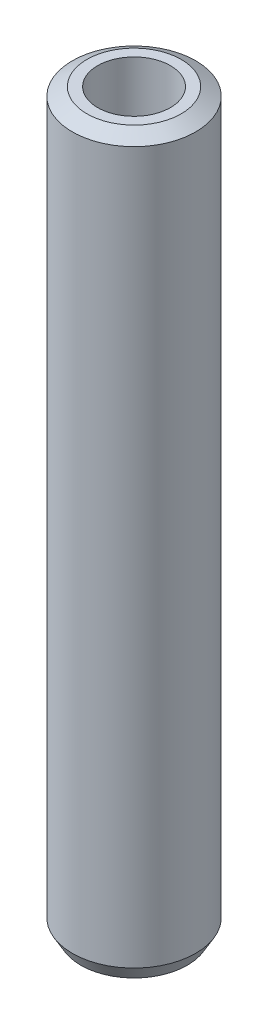
ISO-10303-21;
HEADER;
FILE_DESCRIPTION(('STEP AP214'),'2;1');
FILE_NAME('part.step','',(''),(''),'','','');
FILE_SCHEMA(('AUTOMOTIVE_DESIGN { 1 0 10303 214 1 1 1 1 }'));
ENDSEC;
DATA;
#1=APPLICATION_CONTEXT('core data for automotive mechanical design processes');
#2=APPLICATION_PROTOCOL_DEFINITION('international standard','automotive_design',2000,#1);
#3=PRODUCT_CONTEXT('',#1,'mechanical');
#4=PRODUCT('Part','Part','',(#3));
#5=PRODUCT_RELATED_PRODUCT_CATEGORY('part','',(#4));
#6=PRODUCT_DEFINITION_FORMATION('','',#4);
#7=PRODUCT_DEFINITION_CONTEXT('part definition',#1,'design');
#8=PRODUCT_DEFINITION('design','',#6,#7);
#9=PRODUCT_DEFINITION_SHAPE('','',#8);
#10=(LENGTH_UNIT() NAMED_UNIT(*) SI_UNIT(.MILLI.,.METRE.));
#11=(NAMED_UNIT(*) PLANE_ANGLE_UNIT() SI_UNIT($,.RADIAN.));
#12=(NAMED_UNIT(*) SI_UNIT($,.STERADIAN.) SOLID_ANGLE_UNIT());
#13=UNCERTAINTY_MEASURE_WITH_UNIT(LENGTH_MEASURE(1.E-05),#10,'distance_accuracy_value','');
#14=(GEOMETRIC_REPRESENTATION_CONTEXT(3) GLOBAL_UNCERTAINTY_ASSIGNED_CONTEXT((#13)) GLOBAL_UNIT_ASSIGNED_CONTEXT((#10,
#11,#12)) REPRESENTATION_CONTEXT('',''));
#15=CARTESIAN_POINT('',(0.,0.,0.));
#16=DIRECTION('',(0.,0.,1.));
#17=DIRECTION('',(1.,0.,0.));
#18=AXIS2_PLACEMENT_3D('',#15,#16,#17);
#19=CARTESIAN_POINT('',(0.,297.604528577558,0.));
#20=DIRECTION('',(0.,-1.,0.));
#21=DIRECTION('',(0.,0.,-1.));
#22=AXIS2_PLACEMENT_3D('',#19,#20,#21);
#23=CYLINDRICAL_SURFACE('',#22,25.);
#24=CARTESIAN_POINT('',(0.,294.204174490772,0.));
#25=DIRECTION('',(0.,1.,0.));
#26=DIRECTION('',(0.,0.,1.));
#27=AXIS2_PLACEMENT_3D('',#24,#25,#26);
#28=CIRCLE('',#27,25.);
#29=CARTESIAN_POINT('',(0.,294.204174490772,-25.));
#30=VERTEX_POINT('',#29);
#31=EDGE_CURVE('E50',#30,#30,#28,.F.);
#32=CARTESIAN_POINT('',(0.,5.88958604203754,0.));
#33=DIRECTION('',(0.,1.,0.));
#34=DIRECTION('',(0.,0.,1.));
#35=AXIS2_PLACEMENT_3D('',#32,#33,#34);
#36=CIRCLE('',#35,25.);
#37=CARTESIAN_POINT('',(0.,5.88958604203749,-25.));
#38=VERTEX_POINT('',#37);
#39=EDGE_CURVE('E51',#38,#38,#36,.T.);
#40=CARTESIAN_POINT('',(0.,294.204174490772,-25.));
#41=CARTESIAN_POINT('',(0.,291.200897527764,-25.));
#42=CARTESIAN_POINT('',(0.,288.197620564757,-25.));
#43=CARTESIAN_POINT('',(0.,282.191066638741,-25.));
#44=CARTESIAN_POINT('',(0.,279.187789675734,-25.));
#45=CARTESIAN_POINT('',(0.,273.181235749718,-25.));
#46=CARTESIAN_POINT('',(0.,270.177958786711,-25.));
#47=CARTESIAN_POINT('',(0.,264.171404860696,-25.));
#48=CARTESIAN_POINT('',(0.,261.168127897688,-25.));
#49=CARTESIAN_POINT('',(0.,255.161573971673,-25.));
#50=CARTESIAN_POINT('',(0.,252.158297008665,-25.));
#51=CARTESIAN_POINT('',(0.,246.15174308265,-25.));
#52=CARTESIAN_POINT('',(0.,243.148466119642,-25.));
#53=CARTESIAN_POINT('',(0.,237.141912193627,-25.));
#54=CARTESIAN_POINT('',(0.,234.138635230619,-25.));
#55=CARTESIAN_POINT('',(0.,228.132081304604,-25.));
#56=CARTESIAN_POINT('',(0.,225.128804341596,-25.));
#57=CARTESIAN_POINT('',(0.,219.122250415581,-25.));
#58=CARTESIAN_POINT('',(0.,216.118973452573,-25.));
#59=CARTESIAN_POINT('',(0.,210.112419526558,-25.));
#60=CARTESIAN_POINT('',(0.,207.10914256355,-25.));
#61=CARTESIAN_POINT('',(0.,201.102588637535,-25.));
#62=CARTESIAN_POINT('',(0.,198.099311674527,-25.));
#63=CARTESIAN_POINT('',(0.,192.092757748512,-25.));
#64=CARTESIAN_POINT('',(0.,189.089480785504,-25.));
#65=CARTESIAN_POINT('',(0.,183.082926859489,-25.));
#66=CARTESIAN_POINT('',(0.,180.079649896481,-25.));
#67=CARTESIAN_POINT('',(0.,174.073095970466,-25.));
#68=CARTESIAN_POINT('',(0.,171.069819007458,-25.));
#69=CARTESIAN_POINT('',(0.,165.063265081443,-25.));
#70=CARTESIAN_POINT('',(0.,162.059988118435,-25.));
#71=CARTESIAN_POINT('',(0.,156.05343419242,-25.));
#72=CARTESIAN_POINT('',(0.,153.050157229412,-25.));
#73=CARTESIAN_POINT('',(0.,147.043603303397,-25.));
#74=CARTESIAN_POINT('',(0.,144.040326340389,-25.));
#75=CARTESIAN_POINT('',(0.,138.033772414374,-25.));
#76=CARTESIAN_POINT('',(0.,135.030495451367,-25.));
#77=CARTESIAN_POINT('',(0.,129.023941525351,-25.));
#78=CARTESIAN_POINT('',(0.,126.020664562344,-25.));
#79=CARTESIAN_POINT('',(0.,120.014110636328,-25.));
#80=CARTESIAN_POINT('',(0.,117.010833673321,-25.));
#81=CARTESIAN_POINT('',(0.,111.004279747305,-25.));
#82=CARTESIAN_POINT('',(0.,108.001002784298,-25.));
#83=CARTESIAN_POINT('',(0.,101.994448858282,-25.));
#84=CARTESIAN_POINT('',(0.,98.9911718952747,-25.));
#85=CARTESIAN_POINT('',(0.,92.9846179692594,-25.));
#86=CARTESIAN_POINT('',(0.,89.9813410062518,-25.));
#87=CARTESIAN_POINT('',(0.,83.9747870802364,-25.));
#88=CARTESIAN_POINT('',(0.,80.9715101172288,-25.));
#89=CARTESIAN_POINT('',(0.,74.9649561912135,-25.));
#90=CARTESIAN_POINT('',(0.,71.9616792282058,-25.));
#91=CARTESIAN_POINT('',(0.,65.9551253021905,-25.));
#92=CARTESIAN_POINT('',(0.,62.9518483391829,-25.));
#93=CARTESIAN_POINT('',(0.,56.9452944131676,-25.));
#94=CARTESIAN_POINT('',(0.,53.9420174501599,-25.));
#95=CARTESIAN_POINT('',(0.,47.9354635241446,-25.));
#96=CARTESIAN_POINT('',(0.,44.932186561137,-25.));
#97=CARTESIAN_POINT('',(0.,38.9256326351217,-25.));
#98=CARTESIAN_POINT('',(0.,35.922355672114,-25.));
#99=CARTESIAN_POINT('',(0.,29.9158017460987,-25.));
#100=CARTESIAN_POINT('',(0.,26.9125247830911,-25.));
#101=CARTESIAN_POINT('',(0.,20.9059708570758,-25.));
#102=CARTESIAN_POINT('',(0.,17.9026938940681,-25.));
#103=CARTESIAN_POINT('',(0.,11.8961399680528,-25.));
#104=CARTESIAN_POINT('',(0.,8.89286300504514,-25.));
#105=CARTESIAN_POINT('',(0.,5.88958604203749,-25.));
#106=B_SPLINE_CURVE_WITH_KNOTS('',3,(#40,#41,#42,#43,#44,#45,#46,#47,#48,#49,#50,#51,#52,#53,
#54,#55,#56,#57,#58,#59,#60,#61,#62,#63,#64,#65,#66,#67,#68,#69,#70,#71,#72,#73,#74,#75,#76,#77,
#78,#79,#80,#81,#82,#83,#84,#85,#86,#87,#88,#89,#90,#91,#92,#93,#94,#95,#96,#97,#98,#99,#100,
#101,#102,#103,#104,#105),.UNSPECIFIED.,.F.,.F.,(4,2,2,2,2,2,2,2,2,2,2,2,2,2,2,2,2,2,2,2,2,2,2,
2,2,2,2,2,2,2,2,2,4),(0.,9.00983088902291,18.0196617780459,27.0294926670688,36.0393235560918,
45.0491544451148,54.0589853341377,63.0688162231606,72.0786471121836,81.0884780012066,
90.0983088902295,99.1081397792525,108.117970668275,117.127801557298,126.137632446321,
135.147463335344,144.157294224367,153.16712511339,162.176956002413,171.186786891436,
180.196617780459,189.206448669482,198.216279558505,207.226110447528,216.235941336551,
225.245772225574,234.255603114597,243.26543400362,252.275264892643,261.285095781666,
270.294926670689,279.304757559712,288.314588448735),.UNSPECIFIED.);
#107=EDGE_CURVE('BSEAM39',#30,#38,#106,.T.);
#108=ORIENTED_EDGE('',*,*,#31,.T.);
#109=ORIENTED_EDGE('',*,*,#39,.T.);
#110=ORIENTED_EDGE('',*,*,#107,.T.);
#111=ORIENTED_EDGE('',*,*,#107,.F.);
#112=EDGE_LOOP('',(#108,#110,#109,#111));
#113=FACE_BOUND('',#112,.T.);
#114=ADVANCED_FACE('F39',(#113),#23,.T.);
#115=CARTESIAN_POINT('',(0.,297.604528577558,0.));
#116=DIRECTION('',(0.,1.,0.));
#117=DIRECTION('',(0.,0.,1.));
#118=AXIS2_PLACEMENT_3D('',#115,#116,#117);
#119=PLANE('',#118);
#120=CARTESIAN_POINT('',(0.,297.604528577558,0.));
#121=DIRECTION('',(0.,1.,0.));
#122=DIRECTION('',(0.,0.,1.));
#123=AXIS2_PLACEMENT_3D('',#120,#121,#122);
#124=CIRCLE('',#123,19.1104139579631);
#125=CARTESIAN_POINT('',(0.,297.604528577557,-19.1104139579632));
#126=VERTEX_POINT('',#125);
#127=EDGE_CURVE('E54',#126,#126,#124,.T.);
#128=ORIENTED_EDGE('',*,*,#127,.T.);
#129=EDGE_LOOP('',(#128));
#130=FACE_BOUND('',#129,.T.);
#131=CARTESIAN_POINT('',(0.,297.604528577558,0.));
#132=DIRECTION('',(0.,1.,0.));
#133=DIRECTION('',(0.,0.,1.));
#134=AXIS2_PLACEMENT_3D('',#131,#132,#133);
#135=CIRCLE('',#134,14.7536107935346);
#136=CARTESIAN_POINT('',(0.,297.604528577558,-14.7536107935346));
#137=VERTEX_POINT('',#136);
#138=EDGE_CURVE('E58',#137,#137,#135,.T.);
#139=ORIENTED_EDGE('',*,*,#138,.F.);
#140=EDGE_LOOP('',(#139));
#141=FACE_BOUND('',#140,.T.);
#142=ADVANCED_FACE('F69',(#130,#141),#119,.T.);
#143=CARTESIAN_POINT('',(0.,0.,0.));
#144=DIRECTION('',(0.,1.,0.));
#145=DIRECTION('',(0.,0.,1.));
#146=AXIS2_PLACEMENT_3D('',#143,#144,#145);
#147=PLANE('',#146);
#148=CARTESIAN_POINT('',(0.,0.,0.));
#149=DIRECTION('',(0.,1.,0.));
#150=DIRECTION('',(0.,0.,1.));
#151=AXIS2_PLACEMENT_3D('',#148,#149,#150);
#152=CIRCLE('',#151,21.5996459132142);
#153=CARTESIAN_POINT('',(0.,0.,21.5996459132142));
#154=VERTEX_POINT('',#153);
#155=EDGE_CURVE('E10',#154,#154,#152,.F.);
#156=ORIENTED_EDGE('',*,*,#155,.T.);
#157=EDGE_LOOP('',(#156));
#158=FACE_BOUND('',#157,.T.);
#159=CARTESIAN_POINT('',(0.,0.,0.));
#160=DIRECTION('',(0.,1.,0.));
#161=DIRECTION('',(0.,0.,1.));
#162=AXIS2_PLACEMENT_3D('',#159,#160,#161);
#163=CIRCLE('',#162,14.7536107935346);
#164=CARTESIAN_POINT('',(0.,0.,-14.7536107935346));
#165=VERTEX_POINT('',#164);
#166=EDGE_CURVE('E63',#165,#165,#163,.T.);
#167=ORIENTED_EDGE('',*,*,#166,.T.);
#168=EDGE_LOOP('',(#167));
#169=FACE_BOUND('',#168,.T.);
#170=ADVANCED_FACE('F75',(#158,#169),#147,.F.);
#171=CARTESIAN_POINT('',(0.,297.604528577558,0.));
#172=DIRECTION('',(0.,-1.,0.));
#173=DIRECTION('',(0.,0.,-1.));
#174=AXIS2_PLACEMENT_3D('',#171,#172,#173);
#175=CYLINDRICAL_SURFACE('',#174,14.7536107935346);
#176=CARTESIAN_POINT('',(0.,297.604528577558,-14.7536107935346));
#177=CARTESIAN_POINT('',(0.,294.504481404875,-14.7536107935346));
#178=CARTESIAN_POINT('',(0.,291.404434232192,-14.7536107935346));
#179=CARTESIAN_POINT('',(0.,285.204339886826,-14.7536107935346));
#180=CARTESIAN_POINT('',(0.,282.104292714143,-14.7536107935346));
#181=CARTESIAN_POINT('',(0.,275.904198368777,-14.7536107935346));
#182=CARTESIAN_POINT('',(0.,272.804151196094,-14.7536107935346));
#183=CARTESIAN_POINT('',(0.,266.604056850729,-14.7536107935346));
#184=CARTESIAN_POINT('',(0.,263.504009678046,-14.7536107935346));
#185=CARTESIAN_POINT('',(0.,257.30391533268,-14.7536107935346));
#186=CARTESIAN_POINT('',(0.,254.203868159997,-14.7536107935346));
#187=CARTESIAN_POINT('',(0.,248.003773814631,-14.7536107935346));
#188=CARTESIAN_POINT('',(0.,244.903726641948,-14.7536107935346));
#189=CARTESIAN_POINT('',(0.,238.703632296583,-14.7536107935346));
#190=CARTESIAN_POINT('',(0.,235.6035851239,-14.7536107935346));
#191=CARTESIAN_POINT('',(0.,229.403490778534,-14.7536107935346));
#192=CARTESIAN_POINT('',(0.,226.303443605851,-14.7536107935346));
#193=CARTESIAN_POINT('',(0.,220.103349260485,-14.7536107935346));
#194=CARTESIAN_POINT('',(0.,217.003302087802,-14.7536107935346));
#195=CARTESIAN_POINT('',(0.,210.803207742437,-14.7536107935346));
#196=CARTESIAN_POINT('',(0.,207.703160569754,-14.7536107935346));
#197=CARTESIAN_POINT('',(0.,201.503066224388,-14.7536107935346));
#198=CARTESIAN_POINT('',(0.,198.403019051705,-14.7536107935346));
#199=CARTESIAN_POINT('',(0.,192.202924706339,-14.7536107935346));
#200=CARTESIAN_POINT('',(0.,189.102877533656,-14.7536107935346));
#201=CARTESIAN_POINT('',(0.,182.902783188291,-14.7536107935346));
#202=CARTESIAN_POINT('',(0.,179.802736015608,-14.7536107935346));
#203=CARTESIAN_POINT('',(0.,173.602641670242,-14.7536107935346));
#204=CARTESIAN_POINT('',(0.,170.502594497559,-14.7536107935346));
#205=CARTESIAN_POINT('',(0.,164.302500152193,-14.7536107935346));
#206=CARTESIAN_POINT('',(0.,161.20245297951,-14.7536107935346));
#207=CARTESIAN_POINT('',(0.,155.002358634145,-14.7536107935346));
#208=CARTESIAN_POINT('',(0.,151.902311461462,-14.7536107935346));
#209=CARTESIAN_POINT('',(0.,145.702217116096,-14.7536107935346));
#210=CARTESIAN_POINT('',(0.,142.602169943413,-14.7536107935346));
#211=CARTESIAN_POINT('',(0.,136.402075598047,-14.7536107935346));
#212=CARTESIAN_POINT('',(0.,133.302028425364,-14.7536107935346));
#213=CARTESIAN_POINT('',(0.,127.101934079999,-14.7536107935346));
#214=CARTESIAN_POINT('',(0.,124.001886907316,-14.7536107935346));
#215=CARTESIAN_POINT('',(0.,117.80179256195,-14.7536107935346));
#216=CARTESIAN_POINT('',(0.,114.701745389267,-14.7536107935346));
#217=CARTESIAN_POINT('',(0.,108.501651043901,-14.7536107935346));
#218=CARTESIAN_POINT('',(0.,105.401603871218,-14.7536107935346));
#219=CARTESIAN_POINT('',(0.,99.2015095258525,-14.7536107935346));
#220=CARTESIAN_POINT('',(0.,96.1014623531696,-14.7536107935346));
#221=CARTESIAN_POINT('',(0.,89.9013680078038,-14.7536107935346));
#222=CARTESIAN_POINT('',(0.,86.8013208351209,-14.7536107935346));
#223=CARTESIAN_POINT('',(0.,80.6012264897551,-14.7536107935346));
#224=CARTESIAN_POINT('',(0.,77.5011793170722,-14.7536107935346));
#225=CARTESIAN_POINT('',(0.,71.3010849717065,-14.7536107935346));
#226=CARTESIAN_POINT('',(0.,68.2010377990236,-14.7536107935346));
#227=CARTESIAN_POINT('',(0.,62.0009434536578,-14.7536107935346));
#228=CARTESIAN_POINT('',(0.,58.9008962809749,-14.7536107935346));
#229=CARTESIAN_POINT('',(0.,52.7008019356091,-14.7536107935346));
#230=CARTESIAN_POINT('',(0.,49.6007547629263,-14.7536107935346));
#231=CARTESIAN_POINT('',(0.,43.4006604175605,-14.7536107935346));
#232=CARTESIAN_POINT('',(0.,40.3006132448776,-14.7536107935346));
#233=CARTESIAN_POINT('',(0.,34.1005188995118,-14.7536107935346));
#234=CARTESIAN_POINT('',(0.,31.0004717268289,-14.7536107935346));
#235=CARTESIAN_POINT('',(0.,24.8003773814631,-14.7536107935346));
#236=CARTESIAN_POINT('',(0.,21.7003302087802,-14.7536107935346));
#237=CARTESIAN_POINT('',(0.,15.5002358634145,-14.7536107935346));
#238=CARTESIAN_POINT('',(0.,12.4001886907316,-14.7536107935346));
#239=CARTESIAN_POINT('',(0.,6.2000943453658,-14.7536107935346));
#240=CARTESIAN_POINT('',(0.,3.1000471726829,-14.7536107935346));
#241=CARTESIAN_POINT('',(0.,0.,-14.7536107935346));
#242=B_SPLINE_CURVE_WITH_KNOTS('',3,(#176,#177,#178,#179,#180,#181,#182,#183,#184,#185,#186,
#187,#188,#189,#190,#191,#192,#193,#194,#195,#196,#197,#198,#199,#200,#201,#202,#203,#204,#205,
#206,#207,#208,#209,#210,#211,#212,#213,#214,#215,#216,#217,#218,#219,#220,#221,#222,#223,#224,
#225,#226,#227,#228,#229,#230,#231,#232,#233,#234,#235,#236,#237,#238,#239,#240,#241),
.UNSPECIFIED.,.F.,.F.,(4,2,2,2,2,2,2,2,2,2,2,2,2,2,2,2,2,2,2,2,2,2,2,2,2,2,2,2,2,2,2,2,4),(0.,
9.3001415180487,18.6002830360974,27.900424554146,37.2005660721947,46.5007075902434,
55.8008491082921,65.1009906263407,74.4011321443894,83.7012736624381,93.0014151804868,
102.301556698535,111.601698216584,120.901839734633,130.201981252681,139.50212277073,
148.802264288779,158.102405806827,167.402547324876,176.702688842925,186.002830360973,
195.302971879022,204.603113397071,213.90325491512,223.203396433168,232.503537951217,
241.803679469266,251.103820987314,260.403962505363,269.704104023412,279.00424554146,
288.304387059509,297.604528577558),.UNSPECIFIED.);
#243=EDGE_CURVE('BSEAM70',#137,#165,#242,.T.);
#244=ORIENTED_EDGE('',*,*,#138,.T.);
#245=ORIENTED_EDGE('',*,*,#166,.F.);
#246=ORIENTED_EDGE('',*,*,#243,.T.);
#247=ORIENTED_EDGE('',*,*,#243,.F.);
#248=EDGE_LOOP('',(#244,#246,#245,#247));
#249=FACE_BOUND('',#248,.T.);
#250=ADVANCED_FACE('F70',(#249),#175,.F.);
#251=CARTESIAN_POINT('',(0.,297.604528577558,0.));
#252=DIRECTION('',(0.,-1.,0.));
#253=DIRECTION('',(0.,0.,-1.));
#254=AXIS2_PLACEMENT_3D('',#251,#252,#253);
#255=CONICAL_SURFACE('',#254,19.1104139579631,1.0471975511966);
#256=CARTESIAN_POINT('',(0.,294.204174490772,-25.));
#257=CARTESIAN_POINT('',(0.,294.239594845843,-24.9386501453955));
#258=CARTESIAN_POINT('',(0.,294.275015200913,-24.8773002907909));
#259=CARTESIAN_POINT('',(0.,294.345855911055,-24.7546005815819));
#260=CARTESIAN_POINT('',(0.,294.381276266125,-24.6932507269773));
#261=CARTESIAN_POINT('',(0.,294.452116976267,-24.5705510177682));
#262=CARTESIAN_POINT('',(0.,294.487537331337,-24.5092011631636));
#263=CARTESIAN_POINT('',(0.,294.558378041479,-24.3865014539545));
#264=CARTESIAN_POINT('',(0.,294.59379839655,-24.32515159935));
#265=CARTESIAN_POINT('',(0.,294.664639106691,-24.2024518901409));
#266=CARTESIAN_POINT('',(0.,294.700059461762,-24.1411020355363));
#267=CARTESIAN_POINT('',(0.,294.770900171903,-24.0184023263272));
#268=CARTESIAN_POINT('',(0.,294.806320526974,-23.9570524717227));
#269=CARTESIAN_POINT('',(0.,294.877161237115,-23.8343527625136));
#270=CARTESIAN_POINT('',(0.,294.912581592186,-23.773002907909));
#271=CARTESIAN_POINT('',(0.,294.983422302327,-23.6503031986999));
#272=CARTESIAN_POINT('',(0.,295.018842657398,-23.5889533440954));
#273=CARTESIAN_POINT('',(0.,295.089683367539,-23.4662536348863));
#274=CARTESIAN_POINT('',(0.,295.12510372261,-23.4049037802817));
#275=CARTESIAN_POINT('',(0.,295.195944432751,-23.2822040710726));
#276=CARTESIAN_POINT('',(0.,295.231364787822,-23.2208542164681));
#277=CARTESIAN_POINT('',(0.,295.302205497963,-23.098154507259));
#278=CARTESIAN_POINT('',(0.,295.337625853034,-23.0368046526544));
#279=CARTESIAN_POINT('',(0.,295.408466563175,-22.9141049434453));
#280=CARTESIAN_POINT('',(0.,295.443886918246,-22.8527550888408));
#281=CARTESIAN_POINT('',(0.,295.514727628387,-22.7300553796317));
#282=CARTESIAN_POINT('',(0.,295.550147983458,-22.6687055250271));
#283=CARTESIAN_POINT('',(0.,295.620988693599,-22.546005815818));
#284=CARTESIAN_POINT('',(0.,295.65640904867,-22.4846559612135));
#285=CARTESIAN_POINT('',(0.,295.727249758811,-22.3619562520044));
#286=CARTESIAN_POINT('',(0.,295.762670113882,-22.3006063973998));
#287=CARTESIAN_POINT('',(0.,295.833510824023,-22.1779066881907));
#288=CARTESIAN_POINT('',(0.,295.868931179094,-22.1165568335862));
#289=CARTESIAN_POINT('',(0.,295.939771889235,-21.9938571243771));
#290=CARTESIAN_POINT('',(0.,295.975192244306,-21.9325072697725));
#291=CARTESIAN_POINT('',(0.,296.046032954448,-21.8098075605634));
#292=CARTESIAN_POINT('',(0.,296.081453309518,-21.7484577059589));
#293=CARTESIAN_POINT('',(0.,296.15229401966,-21.6257579967498));
#294=CARTESIAN_POINT('',(0.,296.18771437473,-21.5644081421452));
#295=CARTESIAN_POINT('',(0.,296.258555084872,-21.4417084329361));
#296=CARTESIAN_POINT('',(0.,296.293975439942,-21.3803585783316));
#297=CARTESIAN_POINT('',(0.,296.364816150084,-21.2576588691225));
#298=CARTESIAN_POINT('',(0.,296.400236505154,-21.1963090145179));
#299=CARTESIAN_POINT('',(0.,296.471077215296,-21.0736093053088));
#300=CARTESIAN_POINT('',(0.,296.506497570366,-21.0122594507043));
#301=CARTESIAN_POINT('',(0.,296.577338280508,-20.8895597414952));
#302=CARTESIAN_POINT('',(0.,296.612758635578,-20.8282098868906));
#303=CARTESIAN_POINT('',(0.,296.68359934572,-20.7055101776815));
#304=CARTESIAN_POINT('',(0.,296.71901970079,-20.644160323077));
#305=CARTESIAN_POINT('',(0.,296.789860410932,-20.5214606138679));
#306=CARTESIAN_POINT('',(0.,296.825280766002,-20.4601107592633));
#307=CARTESIAN_POINT('',(0.,296.896121476144,-20.3374110500542));
#308=CARTESIAN_POINT('',(0.,296.931541831215,-20.2760611954496));
#309=CARTESIAN_POINT('',(0.,297.002382541356,-20.1533614862405));
#310=CARTESIAN_POINT('',(0.,297.037802896427,-20.092011631636));
#311=CARTESIAN_POINT('',(0.,297.108643606568,-19.9693119224269));
#312=CARTESIAN_POINT('',(0.,297.144063961639,-19.9079620678223));
#313=CARTESIAN_POINT('',(0.,297.21490467178,-19.7852623586132));
#314=CARTESIAN_POINT('',(0.,297.250325026851,-19.7239125040087));
#315=CARTESIAN_POINT('',(0.,297.321165736992,-19.6012127947996));
#316=CARTESIAN_POINT('',(0.,297.356586092063,-19.539862940195));
#317=CARTESIAN_POINT('',(0.,297.427426802204,-19.4171632309859));
#318=CARTESIAN_POINT('',(0.,297.462847157275,-19.3558133763814));
#319=CARTESIAN_POINT('',(0.,297.533687867416,-19.2331136671723));
#320=CARTESIAN_POINT('',(0.,297.569108222487,-19.1717638125677));
#321=CARTESIAN_POINT('',(0.,297.604528577558,-19.1104139579632));
#322=B_SPLINE_CURVE_WITH_KNOTS('',3,(#256,#257,#258,#259,#260,#261,#262,#263,#264,#265,#266,
#267,#268,#269,#270,#271,#272,#273,#274,#275,#276,#277,#278,#279,#280,#281,#282,#283,#284,#285,
#286,#287,#288,#289,#290,#291,#292,#293,#294,#295,#296,#297,#298,#299,#300,#301,#302,#303,#304,
#305,#306,#307,#308,#309,#310,#311,#312,#313,#314,#315,#316,#317,#318,#319,#320,#321),
.UNSPECIFIED.,.F.,.F.,(4,2,2,2,2,2,2,2,2,2,2,2,2,2,2,2,2,2,2,2,2,2,2,2,2,2,2,2,2,2,2,2,4),(0.,
0.212522130424094,0.425044260848188,0.637566391272284,0.850088521696378,1.06261065212047,
1.27513278254457,1.48765491296863,1.70017704339273,1.91269917381683,2.12522130424092,
2.33774343466501,2.55026556508911,2.76278769551318,2.97530982593727,3.18783195636137,
3.40035408678546,3.61287621720956,3.82539834763365,4.03792047805775,4.25044260848181,
4.46296473890591,4.67548686933,4.8880089997541,5.10053113017819,5.31305326060229,
5.52557539102636,5.73809752145045,5.95061965187455,6.16314178229864,6.37566391272273,
6.58818604314683,6.80070817357092),.UNSPECIFIED.);
#323=EDGE_CURVE('BSEAM81',#30,#126,#322,.T.);
#324=ORIENTED_EDGE('',*,*,#31,.F.);
#325=ORIENTED_EDGE('',*,*,#127,.F.);
#326=ORIENTED_EDGE('',*,*,#323,.T.);
#327=ORIENTED_EDGE('',*,*,#323,.F.);
#328=EDGE_LOOP('',(#324,#326,#325,#327));
#329=FACE_BOUND('',#328,.T.);
#330=ADVANCED_FACE('F81',(#329),#255,.T.);
#331=CARTESIAN_POINT('',(0.,5.88958604203749,0.));
#332=DIRECTION('',(0.,1.,0.));
#333=DIRECTION('',(0.,0.,1.));
#334=AXIS2_PLACEMENT_3D('',#331,#332,#333);
#335=CONICAL_SURFACE('',#334,25.,0.523598775598303);
#336=ORIENTED_EDGE('',*,*,#155,.F.);
#337=EDGE_LOOP('',(#336));
#338=FACE_BOUND('',#337,.T.);
#339=ORIENTED_EDGE('',*,*,#39,.F.);
#340=EDGE_LOOP('',(#339));
#341=FACE_BOUND('',#340,.T.);
#342=ADVANCED_FACE('F45',(#338,#341),#335,.T.);
#343=CLOSED_SHELL('',(#114,#142,#170,#250,#330,#342));
#344=MANIFOLD_SOLID_BREP('B2',#343);
#345=ADVANCED_BREP_SHAPE_REPRESENTATION('',(#18,#344),#14);
#346=SHAPE_DEFINITION_REPRESENTATION(#9,#345);
ENDSEC;
END-ISO-10303-21;
